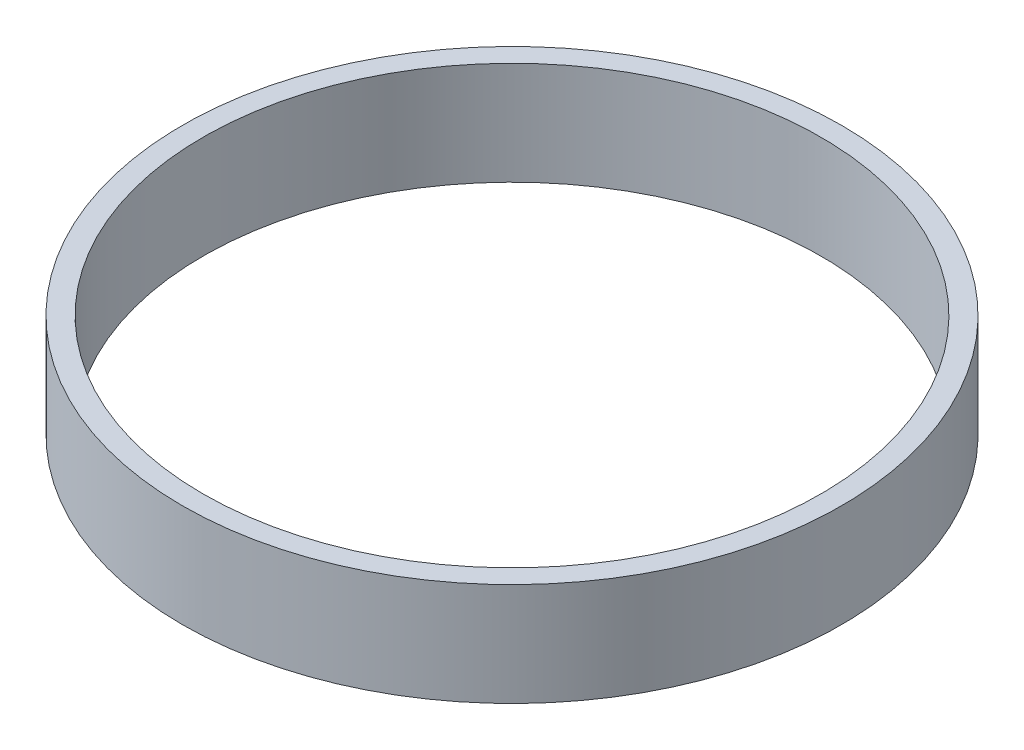
ISO-10303-21;
HEADER;
FILE_DESCRIPTION(('STEP AP214'),'2;1');
FILE_NAME('part.step','',(''),(''),'','','');
FILE_SCHEMA(('AUTOMOTIVE_DESIGN { 1 0 10303 214 1 1 1 1 }'));
ENDSEC;
DATA;
#1=APPLICATION_CONTEXT('core data for automotive mechanical design processes');
#2=APPLICATION_PROTOCOL_DEFINITION('international standard','automotive_design',2000,#1);
#3=PRODUCT_CONTEXT('',#1,'mechanical');
#4=PRODUCT('Part','Part','',(#3));
#5=PRODUCT_RELATED_PRODUCT_CATEGORY('part','',(#4));
#6=PRODUCT_DEFINITION_FORMATION('','',#4);
#7=PRODUCT_DEFINITION_CONTEXT('part definition',#1,'design');
#8=PRODUCT_DEFINITION('design','',#6,#7);
#9=PRODUCT_DEFINITION_SHAPE('','',#8);
#10=(LENGTH_UNIT() NAMED_UNIT(*) SI_UNIT(.MILLI.,.METRE.));
#11=(NAMED_UNIT(*) PLANE_ANGLE_UNIT() SI_UNIT($,.RADIAN.));
#12=(NAMED_UNIT(*) SI_UNIT($,.STERADIAN.) SOLID_ANGLE_UNIT());
#13=UNCERTAINTY_MEASURE_WITH_UNIT(LENGTH_MEASURE(1.E-05),#10,'distance_accuracy_value','');
#14=(GEOMETRIC_REPRESENTATION_CONTEXT(3) GLOBAL_UNCERTAINTY_ASSIGNED_CONTEXT((#13)) GLOBAL_UNIT_ASSIGNED_CONTEXT((#10,
#11,#12)) REPRESENTATION_CONTEXT('',''));
#15=CARTESIAN_POINT('',(0.,0.,0.));
#16=DIRECTION('',(0.,0.,1.));
#17=DIRECTION('',(1.,0.,0.));
#18=AXIS2_PLACEMENT_3D('',#15,#16,#17);
#19=CARTESIAN_POINT('',(0.,10.,0.));
#20=DIRECTION('',(0.,1.,0.));
#21=DIRECTION('',(0.,0.,1.));
#22=AXIS2_PLACEMENT_3D('',#19,#20,#21);
#23=PLANE('',#22);
#24=CARTESIAN_POINT('',(0.,10.,0.));
#25=DIRECTION('',(0.,1.,0.));
#26=DIRECTION('',(0.,0.,1.));
#27=AXIS2_PLACEMENT_3D('',#24,#25,#26);
#28=CIRCLE('',#27,32.);
#29=CARTESIAN_POINT('',(0.,10.,32.));
#30=VERTEX_POINT('',#29);
#31=EDGE_CURVE('E10',#30,#30,#28,.T.);
#32=ORIENTED_EDGE('',*,*,#31,.T.);
#33=EDGE_LOOP('',(#32));
#34=FACE_BOUND('',#33,.T.);
#35=CARTESIAN_POINT('',(0.,10.,0.));
#36=DIRECTION('',(0.,1.,0.));
#37=DIRECTION('',(0.,0.,1.));
#38=AXIS2_PLACEMENT_3D('',#35,#36,#37);
#39=CIRCLE('',#38,30.);
#40=CARTESIAN_POINT('',(0.,10.,30.));
#41=VERTEX_POINT('',#40);
#42=EDGE_CURVE('E42',#41,#41,#39,.T.);
#43=ORIENTED_EDGE('',*,*,#42,.F.);
#44=EDGE_LOOP('',(#43));
#45=FACE_BOUND('',#44,.T.);
#46=ADVANCED_FACE('F31',(#34,#45),#23,.T.);
#47=CARTESIAN_POINT('',(0.,0.,0.));
#48=DIRECTION('',(0.,1.,0.));
#49=DIRECTION('',(0.,0.,1.));
#50=AXIS2_PLACEMENT_3D('',#47,#48,#49);
#51=PLANE('',#50);
#52=CARTESIAN_POINT('',(0.,0.,0.));
#53=DIRECTION('',(0.,1.,0.));
#54=DIRECTION('',(0.,0.,1.));
#55=AXIS2_PLACEMENT_3D('',#52,#53,#54);
#56=CIRCLE('',#55,32.);
#57=CARTESIAN_POINT('',(0.,0.,32.));
#58=VERTEX_POINT('',#57);
#59=EDGE_CURVE('E35',#58,#58,#56,.T.);
#60=ORIENTED_EDGE('',*,*,#59,.F.);
#61=EDGE_LOOP('',(#60));
#62=FACE_BOUND('',#61,.T.);
#63=CARTESIAN_POINT('',(0.,0.,0.));
#64=DIRECTION('',(0.,1.,0.));
#65=DIRECTION('',(0.,0.,1.));
#66=AXIS2_PLACEMENT_3D('',#63,#64,#65);
#67=CIRCLE('',#66,30.);
#68=CARTESIAN_POINT('',(0.,0.,30.));
#69=VERTEX_POINT('',#68);
#70=EDGE_CURVE('E44',#69,#69,#67,.T.);
#71=ORIENTED_EDGE('',*,*,#70,.T.);
#72=EDGE_LOOP('',(#71));
#73=FACE_BOUND('',#72,.T.);
#74=ADVANCED_FACE('F54',(#62,#73),#51,.F.);
#75=CARTESIAN_POINT('',(0.,10.,0.));
#76=DIRECTION('',(0.,-1.,0.));
#77=DIRECTION('',(0.,0.,-1.));
#78=AXIS2_PLACEMENT_3D('',#75,#76,#77);
#79=CYLINDRICAL_SURFACE('',#78,32.);
#80=ORIENTED_EDGE('',*,*,#31,.F.);
#81=EDGE_LOOP('',(#80));
#82=FACE_BOUND('',#81,.T.);
#83=ORIENTED_EDGE('',*,*,#59,.T.);
#84=EDGE_LOOP('',(#83));
#85=FACE_BOUND('',#84,.T.);
#86=ADVANCED_FACE('F33',(#82,#85),#79,.T.);
#87=CARTESIAN_POINT('',(0.,10.,0.));
#88=DIRECTION('',(0.,-1.,0.));
#89=DIRECTION('',(0.,0.,-1.));
#90=AXIS2_PLACEMENT_3D('',#87,#88,#89);
#91=CYLINDRICAL_SURFACE('',#90,30.);
#92=ORIENTED_EDGE('',*,*,#42,.T.);
#93=EDGE_LOOP('',(#92));
#94=FACE_BOUND('',#93,.T.);
#95=ORIENTED_EDGE('',*,*,#70,.F.);
#96=EDGE_LOOP('',(#95));
#97=FACE_BOUND('',#96,.T.);
#98=ADVANCED_FACE('F50',(#94,#97),#91,.F.);
#99=CLOSED_SHELL('',(#46,#74,#86,#98));
#100=MANIFOLD_SOLID_BREP('B2',#99);
#101=ADVANCED_BREP_SHAPE_REPRESENTATION('',(#18,#100),#14);
#102=SHAPE_DEFINITION_REPRESENTATION(#9,#101);
ENDSEC;
END-ISO-10303-21;
